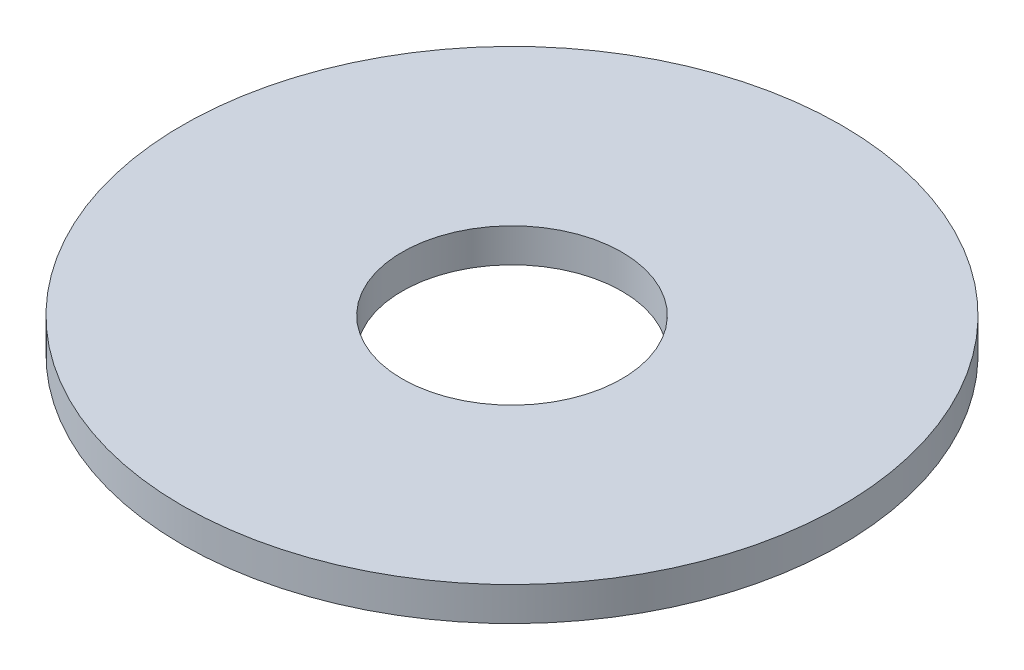
ISO-10303-21;
HEADER;
FILE_DESCRIPTION(('STEP AP214'),'2;1');
FILE_NAME('part.step','',(''),(''),'','','');
FILE_SCHEMA(('AUTOMOTIVE_DESIGN { 1 0 10303 214 1 1 1 1 }'));
ENDSEC;
DATA;
#1=APPLICATION_CONTEXT('core data for automotive mechanical design processes');
#2=APPLICATION_PROTOCOL_DEFINITION('international standard','automotive_design',2000,#1);
#3=PRODUCT_CONTEXT('',#1,'mechanical');
#4=PRODUCT('Part','Part','',(#3));
#5=PRODUCT_RELATED_PRODUCT_CATEGORY('part','',(#4));
#6=PRODUCT_DEFINITION_FORMATION('','',#4);
#7=PRODUCT_DEFINITION_CONTEXT('part definition',#1,'design');
#8=PRODUCT_DEFINITION('design','',#6,#7);
#9=PRODUCT_DEFINITION_SHAPE('','',#8);
#10=(LENGTH_UNIT() NAMED_UNIT(*) SI_UNIT(.MILLI.,.METRE.));
#11=(NAMED_UNIT(*) PLANE_ANGLE_UNIT() SI_UNIT($,.RADIAN.));
#12=(NAMED_UNIT(*) SI_UNIT($,.STERADIAN.) SOLID_ANGLE_UNIT());
#13=UNCERTAINTY_MEASURE_WITH_UNIT(LENGTH_MEASURE(1.E-05),#10,'distance_accuracy_value','');
#14=(GEOMETRIC_REPRESENTATION_CONTEXT(3) GLOBAL_UNCERTAINTY_ASSIGNED_CONTEXT((#13)) GLOBAL_UNIT_ASSIGNED_CONTEXT((#10,
#11,#12)) REPRESENTATION_CONTEXT('',''));
#15=CARTESIAN_POINT('',(0.,0.,0.));
#16=DIRECTION('',(0.,0.,1.));
#17=DIRECTION('',(1.,0.,0.));
#18=AXIS2_PLACEMENT_3D('',#15,#16,#17);
#19=CARTESIAN_POINT('',(0.,10.,0.));
#20=DIRECTION('',(0.,-1.,0.));
#21=DIRECTION('',(0.,0.,-1.));
#22=AXIS2_PLACEMENT_3D('',#19,#20,#21);
#23=CYLINDRICAL_SURFACE('',#22,97.5);
#24=CARTESIAN_POINT('',(0.,10.,0.));
#25=DIRECTION('',(0.,1.,0.));
#26=DIRECTION('',(0.,0.,1.));
#27=AXIS2_PLACEMENT_3D('',#24,#25,#26);
#28=CIRCLE('',#27,97.5);
#29=CARTESIAN_POINT('',(0.,10.,97.5));
#30=VERTEX_POINT('',#29);
#31=EDGE_CURVE('E10',#30,#30,#28,.T.);
#32=ORIENTED_EDGE('',*,*,#31,.F.);
#33=EDGE_LOOP('',(#32));
#34=FACE_BOUND('',#33,.T.);
#35=CARTESIAN_POINT('',(0.,0.,0.));
#36=DIRECTION('',(0.,1.,0.));
#37=DIRECTION('',(0.,0.,1.));
#38=AXIS2_PLACEMENT_3D('',#35,#36,#37);
#39=CIRCLE('',#38,97.5);
#40=CARTESIAN_POINT('',(0.,0.,97.5));
#41=VERTEX_POINT('',#40);
#42=EDGE_CURVE('E37',#41,#41,#39,.T.);
#43=ORIENTED_EDGE('',*,*,#42,.T.);
#44=EDGE_LOOP('',(#43));
#45=FACE_BOUND('',#44,.T.);
#46=ADVANCED_FACE('F40',(#34,#45),#23,.T.);
#47=CARTESIAN_POINT('',(0.,10.,0.));
#48=DIRECTION('',(0.,1.,0.));
#49=DIRECTION('',(0.,0.,1.));
#50=AXIS2_PLACEMENT_3D('',#47,#48,#49);
#51=PLANE('',#50);
#52=CARTESIAN_POINT('',(0.,10.,0.));
#53=DIRECTION('',(0.,1.,0.));
#54=DIRECTION('',(0.,0.,1.));
#55=AXIS2_PLACEMENT_3D('',#52,#53,#54);
#56=CIRCLE('',#55,32.5);
#57=CARTESIAN_POINT('',(0.,10.,32.5));
#58=VERTEX_POINT('',#57);
#59=EDGE_CURVE('E50',#58,#58,#56,.T.);
#60=ORIENTED_EDGE('',*,*,#59,.F.);
#61=EDGE_LOOP('',(#60));
#62=FACE_BOUND('',#61,.T.);
#63=ORIENTED_EDGE('',*,*,#31,.T.);
#64=EDGE_LOOP('',(#63));
#65=FACE_BOUND('',#64,.T.);
#66=ADVANCED_FACE('F59',(#62,#65),#51,.T.);
#67=CARTESIAN_POINT('',(0.,0.,0.));
#68=DIRECTION('',(0.,1.,0.));
#69=DIRECTION('',(0.,0.,1.));
#70=AXIS2_PLACEMENT_3D('',#67,#68,#69);
#71=PLANE('',#70);
#72=CARTESIAN_POINT('',(0.,0.,0.));
#73=DIRECTION('',(0.,1.,0.));
#74=DIRECTION('',(0.,0.,1.));
#75=AXIS2_PLACEMENT_3D('',#72,#73,#74);
#76=CIRCLE('',#75,32.5);
#77=CARTESIAN_POINT('',(0.,0.,32.5));
#78=VERTEX_POINT('',#77);
#79=EDGE_CURVE('E47',#78,#78,#76,.T.);
#80=ORIENTED_EDGE('',*,*,#79,.T.);
#81=EDGE_LOOP('',(#80));
#82=FACE_BOUND('',#81,.T.);
#83=ORIENTED_EDGE('',*,*,#42,.F.);
#84=EDGE_LOOP('',(#83));
#85=FACE_BOUND('',#84,.T.);
#86=ADVANCED_FACE('F58',(#82,#85),#71,.F.);
#87=CARTESIAN_POINT('',(0.,10.,0.));
#88=DIRECTION('',(0.,-1.,0.));
#89=DIRECTION('',(0.,0.,-1.));
#90=AXIS2_PLACEMENT_3D('',#87,#88,#89);
#91=CYLINDRICAL_SURFACE('',#90,32.5);
#92=ORIENTED_EDGE('',*,*,#59,.T.);
#93=EDGE_LOOP('',(#92));
#94=FACE_BOUND('',#93,.T.);
#95=ORIENTED_EDGE('',*,*,#79,.F.);
#96=EDGE_LOOP('',(#95));
#97=FACE_BOUND('',#96,.T.);
#98=ADVANCED_FACE('F54',(#94,#97),#91,.F.);
#99=CLOSED_SHELL('',(#46,#66,#86,#98));
#100=MANIFOLD_SOLID_BREP('B2',#99);
#101=ADVANCED_BREP_SHAPE_REPRESENTATION('',(#18,#100),#14);
#102=SHAPE_DEFINITION_REPRESENTATION(#9,#101);
ENDSEC;
END-ISO-10303-21;
